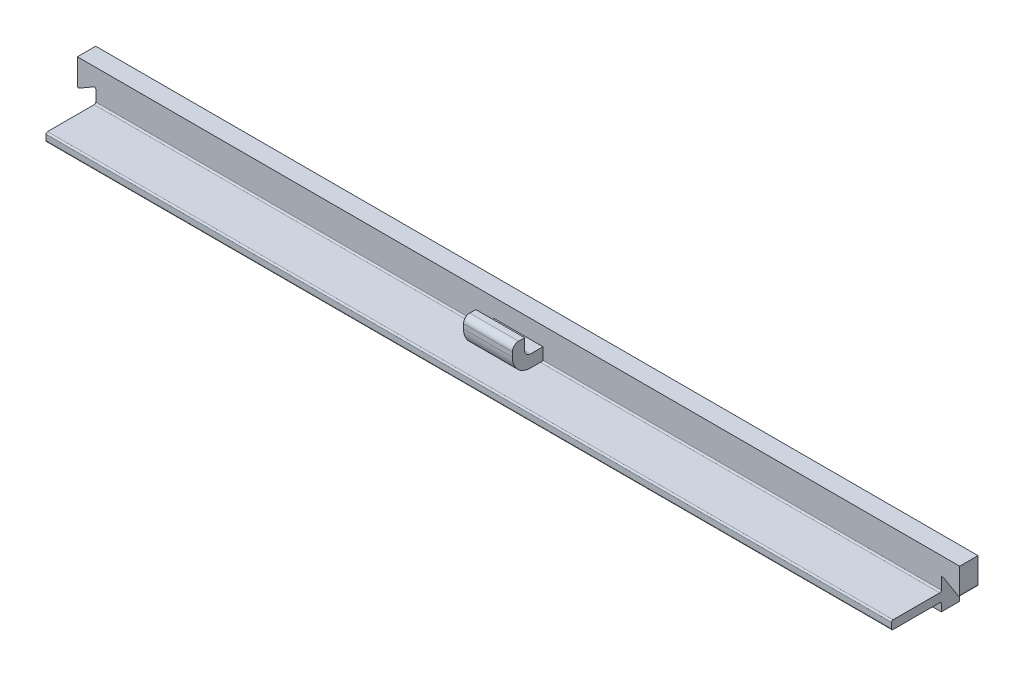
ISO-10303-21;
HEADER;
FILE_DESCRIPTION(('STEP AP214'),'2;1');
FILE_NAME('part.step','',(''),(''),'','','');
FILE_SCHEMA(('AUTOMOTIVE_DESIGN { 1 0 10303 214 1 1 1 1 }'));
ENDSEC;
DATA;
#1=APPLICATION_CONTEXT('core data for automotive mechanical design processes');
#2=APPLICATION_PROTOCOL_DEFINITION('international standard','automotive_design',2000,#1);
#3=PRODUCT_CONTEXT('',#1,'mechanical');
#4=PRODUCT('Part','Part','',(#3));
#5=PRODUCT_RELATED_PRODUCT_CATEGORY('part','',(#4));
#6=PRODUCT_DEFINITION_FORMATION('','',#4);
#7=PRODUCT_DEFINITION_CONTEXT('part definition',#1,'design');
#8=PRODUCT_DEFINITION('design','',#6,#7);
#9=PRODUCT_DEFINITION_SHAPE('','',#8);
#10=(LENGTH_UNIT() NAMED_UNIT(*) SI_UNIT(.MILLI.,.METRE.));
#11=(NAMED_UNIT(*) PLANE_ANGLE_UNIT() SI_UNIT($,.RADIAN.));
#12=(NAMED_UNIT(*) SI_UNIT($,.STERADIAN.) SOLID_ANGLE_UNIT());
#13=UNCERTAINTY_MEASURE_WITH_UNIT(LENGTH_MEASURE(1.E-05),#10,'distance_accuracy_value','');
#14=(GEOMETRIC_REPRESENTATION_CONTEXT(3) GLOBAL_UNCERTAINTY_ASSIGNED_CONTEXT((#13)) GLOBAL_UNIT_ASSIGNED_CONTEXT((#10,
#11,#12)) REPRESENTATION_CONTEXT('',''));
#15=CARTESIAN_POINT('',(0.,0.,0.));
#16=DIRECTION('',(0.,0.,1.));
#17=DIRECTION('',(1.,0.,0.));
#18=AXIS2_PLACEMENT_3D('',#15,#16,#17);
#19=CARTESIAN_POINT('',(-624.215466366464,978.535813606062,11.16));
#20=DIRECTION('',(-1.,0.,0.));
#21=DIRECTION('',(0.,-1.,0.));
#22=AXIS2_PLACEMENT_3D('',#19,#20,#21);
#23=PLANE('',#22);
#24=DIRECTION('',(0.,-1.,0.));
#25=VECTOR('',#24,1.);
#26=CARTESIAN_POINT('',(-624.215466366526,3.91828512811578E-11,3.));
#27=LINE('',#26,#25);
#28=CARTESIAN_POINT('',(-624.215466366464,977.362417099374,3.));
#29=VERTEX_POINT('',#28);
#30=CARTESIAN_POINT('',(-624.215466366465,973.229042070825,3.));
#31=VERTEX_POINT('',#30);
#32=EDGE_CURVE('E378',#29,#31,#27,.T.);
#33=ORIENTED_EDGE('',*,*,#32,.T.);
#34=DIRECTION('',(0.,0.,-1.));
#35=VECTOR('',#34,1.);
#36=CARTESIAN_POINT('',(-624.215466366464,973.229042070825,11.16));
#37=LINE('',#36,#35);
#38=CARTESIAN_POINT('',(-624.215466366465,973.229042070825,0.));
#39=VERTEX_POINT('',#38);
#40=EDGE_CURVE('E346',#31,#39,#37,.T.);
#41=ORIENTED_EDGE('',*,*,#40,.T.);
#42=DIRECTION('',(0.,-1.,0.));
#43=VECTOR('',#42,1.);
#44=CARTESIAN_POINT('',(-624.215466366526,3.91828512811578E-11,0.));
#45=LINE('',#44,#43);
#46=CARTESIAN_POINT('',(-624.215466366464,977.362417099374,0.));
#47=VERTEX_POINT('',#46);
#48=EDGE_CURVE('E317',#47,#39,#45,.T.);
#49=ORIENTED_EDGE('',*,*,#48,.F.);
#50=DIRECTION('',(0.,0.,-1.));
#51=VECTOR('',#50,1.);
#52=CARTESIAN_POINT('',(-624.215466366464,977.362417099374,3.));
#53=LINE('',#52,#51);
#54=EDGE_CURVE('E306',#29,#47,#53,.T.);
#55=ORIENTED_EDGE('',*,*,#54,.F.);
#56=EDGE_LOOP('',(#33,#41,#49,#55));
#57=FACE_BOUND('',#56,.T.);
#58=ADVANCED_FACE('F39',(#57),#23,.F.);
#59=CARTESIAN_POINT('',(-624.415466366467,973.229042070825,11.16));
#60=DIRECTION('',(0.,0.,-1.));
#61=DIRECTION('',(-1.,0.,0.));
#62=AXIS2_PLACEMENT_3D('',#59,#60,#61);
#63=CYLINDRICAL_SURFACE('',#62,0.200000000002849);
#64=CARTESIAN_POINT('',(-624.415466366467,973.229042070825,3.));
#65=DIRECTION('',(0.,0.,1.));
#66=DIRECTION('',(1.,0.,0.));
#67=AXIS2_PLACEMENT_3D('',#64,#65,#66);
#68=CIRCLE('',#67,0.200000000002849);
#69=CARTESIAN_POINT('',(-624.515466366468,973.055836990065,3.));
#70=VERTEX_POINT('',#69);
#71=EDGE_CURVE('E376',#31,#70,#68,.F.);
#72=ORIENTED_EDGE('',*,*,#71,.T.);
#73=DIRECTION('',(0.,0.,-1.));
#74=VECTOR('',#73,1.);
#75=CARTESIAN_POINT('',(-624.515466366468,973.055836990065,11.16));
#76=LINE('',#75,#74);
#77=CARTESIAN_POINT('',(-624.515466366468,973.055836990065,0.));
#78=VERTEX_POINT('',#77);
#79=EDGE_CURVE('E388',#70,#78,#76,.T.);
#80=ORIENTED_EDGE('',*,*,#79,.T.);
#81=CARTESIAN_POINT('',(-624.415466366467,973.229042070825,0.));
#82=DIRECTION('',(0.,0.,1.));
#83=DIRECTION('',(1.,0.,0.));
#84=AXIS2_PLACEMENT_3D('',#81,#82,#83);
#85=CIRCLE('',#84,0.200000000002849);
#86=EDGE_CURVE('E361',#39,#78,#85,.F.);
#87=ORIENTED_EDGE('',*,*,#86,.F.);
#88=ORIENTED_EDGE('',*,*,#40,.F.);
#89=EDGE_LOOP('',(#72,#80,#87,#88));
#90=FACE_BOUND('',#89,.T.);
#91=ADVANCED_FACE('F518',(#90),#63,.T.);
#92=CARTESIAN_POINT('',(-624.515466366468,973.055836990065,11.16));
#93=DIRECTION('',(0.499999999999698,0.866025403784613,0.));
#94=DIRECTION('',(-0.866025403784613,0.499999999999698,0.));
#95=AXIS2_PLACEMENT_3D('',#92,#93,#94);
#96=PLANE('',#95);
#97=DIRECTION('',(-0.866025403784613,0.499999999999698,0.));
#98=VECTOR('',#97,1.);
#99=CARTESIAN_POINT('',(265.216670475465,459.368748278129,3.));
#100=LINE('',#99,#98);
#101=CARTESIAN_POINT('',(-626.926154390442,974.447648369638,3.));
#102=VERTEX_POINT('',#101);
#103=EDGE_CURVE('E374',#70,#102,#100,.T.);
#104=ORIENTED_EDGE('',*,*,#103,.T.);
#105=DIRECTION('',(0.,0.,-1.));
#106=VECTOR('',#105,1.);
#107=CARTESIAN_POINT('',(-626.926154390442,974.447648369638,11.16));
#108=LINE('',#107,#106);
#109=CARTESIAN_POINT('',(-626.926154390442,974.447648369638,0.));
#110=VERTEX_POINT('',#109);
#111=EDGE_CURVE('E385',#102,#110,#108,.T.);
#112=ORIENTED_EDGE('',*,*,#111,.T.);
#113=DIRECTION('',(-0.866025403784613,0.499999999999698,0.));
#114=VECTOR('',#113,1.);
#115=CARTESIAN_POINT('',(265.216670475465,459.368748278129,0.));
#116=LINE('',#115,#114);
#117=EDGE_CURVE('E363',#78,#110,#116,.T.);
#118=ORIENTED_EDGE('',*,*,#117,.F.);
#119=ORIENTED_EDGE('',*,*,#79,.F.);
#120=EDGE_LOOP('',(#104,#112,#118,#119));
#121=FACE_BOUND('',#120,.T.);
#122=ADVANCED_FACE('F524',(#121),#96,.F.);
#123=CARTESIAN_POINT('',(-627.026154390443,974.274443288878,11.16));
#124=DIRECTION('',(0.,0.,-1.));
#125=DIRECTION('',(-1.,0.,0.));
#126=AXIS2_PLACEMENT_3D('',#123,#124,#125);
#127=CYLINDRICAL_SURFACE('',#126,0.200000000002934);
#128=CARTESIAN_POINT('',(-627.026154390443,974.274443288878,3.));
#129=DIRECTION('',(0.,0.,1.));
#130=DIRECTION('',(1.,0.,0.));
#131=AXIS2_PLACEMENT_3D('',#128,#129,#130);
#132=CIRCLE('',#131,0.200000000002934);
#133=CARTESIAN_POINT('',(-627.226154390446,974.274443288878,3.));
#134=VERTEX_POINT('',#133);
#135=EDGE_CURVE('E372',#102,#134,#132,.T.);
#136=ORIENTED_EDGE('',*,*,#135,.T.);
#137=DIRECTION('',(0.,0.,-1.));
#138=VECTOR('',#137,1.);
#139=CARTESIAN_POINT('',(-627.226154390446,974.274443288878,11.16));
#140=LINE('',#139,#138);
#141=CARTESIAN_POINT('',(-627.226154390446,974.274443288878,0.));
#142=VERTEX_POINT('',#141);
#143=EDGE_CURVE('E342',#134,#142,#140,.T.);
#144=ORIENTED_EDGE('',*,*,#143,.T.);
#145=CARTESIAN_POINT('',(-627.026154390443,974.274443288878,0.));
#146=DIRECTION('',(0.,0.,1.));
#147=DIRECTION('',(1.,0.,0.));
#148=AXIS2_PLACEMENT_3D('',#145,#146,#147);
#149=CIRCLE('',#148,0.200000000002934);
#150=EDGE_CURVE('E365',#110,#142,#149,.T.);
#151=ORIENTED_EDGE('',*,*,#150,.F.);
#152=ORIENTED_EDGE('',*,*,#111,.F.);
#153=EDGE_LOOP('',(#136,#144,#151,#152));
#154=FACE_BOUND('',#153,.T.);
#155=ADVANCED_FACE('F532',(#154),#127,.F.);
#156=CARTESIAN_POINT('',(-627.226154390446,974.274443288878,11.16));
#157=DIRECTION('',(-1.,0.,0.));
#158=DIRECTION('',(0.,-1.,0.));
#159=AXIS2_PLACEMENT_3D('',#156,#157,#158);
#160=PLANE('',#159);
#161=DIRECTION('',(0.,-1.,0.));
#162=VECTOR('',#161,1.);
#163=CARTESIAN_POINT('',(-627.226154390428,-1.15917266046248E-11,3.));
#164=LINE('',#163,#162);
#165=CARTESIAN_POINT('',(-627.226154390446,972.454875355935,3.));
#166=VERTEX_POINT('',#165);
#167=EDGE_CURVE('E370',#134,#166,#164,.T.);
#168=ORIENTED_EDGE('',*,*,#167,.T.);
#169=CARTESIAN_POINT('',(-627.226154390446,972.454875355935,3.24999999999998));
#170=DIRECTION('',(-1.,0.,0.));
#171=DIRECTION('',(0.,-1.,0.));
#172=AXIS2_PLACEMENT_3D('',#169,#170,#171);
#173=CIRCLE('',#172,0.25);
#174=CARTESIAN_POINT('',(-627.226154390446,972.204875355935,3.24999999999998));
#175=VERTEX_POINT('',#174);
#176=EDGE_CURVE('E321',#175,#166,#173,.F.);
#177=ORIENTED_EDGE('',*,*,#176,.F.);
#178=DIRECTION('',(0.,0.,-1.));
#179=VECTOR('',#178,1.);
#180=CARTESIAN_POINT('',(-627.226154390446,972.204875355935,280.647202082641));
#181=LINE('',#180,#179);
#182=CARTESIAN_POINT('',(-627.226154390446,972.204875355935,10.9));
#183=VERTEX_POINT('',#182);
#184=EDGE_CURVE('E253',#183,#175,#181,.T.);
#185=ORIENTED_EDGE('',*,*,#184,.F.);
#186=CARTESIAN_POINT('',(-627.226154390446,971.954875355935,10.9));
#187=DIRECTION('',(-1.,0.,0.));
#188=DIRECTION('',(0.,-1.,0.));
#189=AXIS2_PLACEMENT_3D('',#186,#187,#188);
#190=CIRCLE('',#189,0.25);
#191=CARTESIAN_POINT('',(-627.226154390446,971.954875355935,11.15));
#192=VERTEX_POINT('',#191);
#193=EDGE_CURVE('E249',#183,#192,#190,.F.);
#194=ORIENTED_EDGE('',*,*,#193,.T.);
#195=DIRECTION('',(0.,1.,0.));
#196=VECTOR('',#195,1.);
#197=CARTESIAN_POINT('',(-627.226154390446,998.492317099372,11.15));
#198=LINE('',#197,#196);
#199=CARTESIAN_POINT('',(-627.226154390446,971.057317099374,11.15));
#200=VERTEX_POINT('',#199);
#201=EDGE_CURVE('E237',#200,#192,#198,.T.);
#202=ORIENTED_EDGE('',*,*,#201,.F.);
#203=CARTESIAN_POINT('',(-627.226154390446,971.057317099374,10.9));
#204=DIRECTION('',(-1.,0.,0.));
#205=DIRECTION('',(0.,-1.,0.));
#206=AXIS2_PLACEMENT_3D('',#203,#204,#205);
#207=CIRCLE('',#206,0.25);
#208=CARTESIAN_POINT('',(-627.226154390446,970.807317099374,10.9));
#209=VERTEX_POINT('',#208);
#210=EDGE_CURVE('E338',#200,#209,#207,.F.);
#211=ORIENTED_EDGE('',*,*,#210,.T.);
#212=DIRECTION('',(0.,0.,1.));
#213=VECTOR('',#212,1.);
#214=CARTESIAN_POINT('',(-627.226154390446,970.807317099374,280.647202082641));
#215=LINE('',#214,#213);
#216=CARTESIAN_POINT('',(-627.226154390446,970.807317099374,3.24999999999998));
#217=VERTEX_POINT('',#216);
#218=EDGE_CURVE('E303',#217,#209,#215,.T.);
#219=ORIENTED_EDGE('',*,*,#218,.F.);
#220=CARTESIAN_POINT('',(-627.226154390446,970.557317099374,3.24999999999998));
#221=DIRECTION('',(-1.,0.,0.));
#222=DIRECTION('',(0.,-1.,0.));
#223=AXIS2_PLACEMENT_3D('',#220,#221,#222);
#224=CIRCLE('',#223,0.25);
#225=CARTESIAN_POINT('',(-627.226154390446,970.557317099374,3.));
#226=VERTEX_POINT('',#225);
#227=EDGE_CURVE('E298',#226,#217,#224,.F.);
#228=ORIENTED_EDGE('',*,*,#227,.F.);
#229=CARTESIAN_POINT('',(-627.226154390446,969.362417099374,3.));
#230=VERTEX_POINT('',#229);
#231=EDGE_CURVE('E369',#226,#230,#164,.T.);
#232=ORIENTED_EDGE('',*,*,#231,.T.);
#233=DIRECTION('',(0.,0.,-1.));
#234=VECTOR('',#233,1.);
#235=CARTESIAN_POINT('',(-627.226154390446,969.362417099374,3.));
#236=LINE('',#235,#234);
#237=CARTESIAN_POINT('',(-627.226154390446,969.362417099374,0.));
#238=VERTEX_POINT('',#237);
#239=EDGE_CURVE('E334',#230,#238,#236,.T.);
#240=ORIENTED_EDGE('',*,*,#239,.T.);
#241=DIRECTION('',(0.,-1.,0.));
#242=VECTOR('',#241,1.);
#243=CARTESIAN_POINT('',(-627.226154390428,-1.15917266046248E-11,0.));
#244=LINE('',#243,#242);
#245=EDGE_CURVE('E320',#142,#238,#244,.T.);
#246=ORIENTED_EDGE('',*,*,#245,.F.);
#247=ORIENTED_EDGE('',*,*,#143,.F.);
#248=EDGE_LOOP('',(#168,#177,#185,#194,#202,#211,#219,#228,#232,#240,#246,#247));
#249=FACE_BOUND('',#248,.T.);
#250=ADVANCED_FACE('F251',(#249),#160,.F.);
#251=CARTESIAN_POINT('',(-765.729795732973,974.274443288878,11.16));
#252=DIRECTION('',(1.,0.,0.));
#253=DIRECTION('',(0.,1.,0.));
#254=AXIS2_PLACEMENT_3D('',#251,#252,#253);
#255=PLANE('',#254);
#256=DIRECTION('',(0.,1.,0.));
#257=VECTOR('',#256,1.);
#258=CARTESIAN_POINT('',(-765.729795732991,1.41514035775155E-11,3.));
#259=LINE('',#258,#257);
#260=CARTESIAN_POINT('',(-765.729795732973,972.454875355935,3.));
#261=VERTEX_POINT('',#260);
#262=CARTESIAN_POINT('',(-765.729795732973,974.274443288878,3.));
#263=VERTEX_POINT('',#262);
#264=EDGE_CURVE('E332',#261,#263,#259,.T.);
#265=ORIENTED_EDGE('',*,*,#264,.T.);
#266=DIRECTION('',(0.,0.,-1.));
#267=VECTOR('',#266,1.);
#268=CARTESIAN_POINT('',(-765.729795732973,974.274443288878,11.16));
#269=LINE('',#268,#267);
#270=CARTESIAN_POINT('',(-765.729795732973,974.274443288878,0.));
#271=VERTEX_POINT('',#270);
#272=EDGE_CURVE('E353',#263,#271,#269,.T.);
#273=ORIENTED_EDGE('',*,*,#272,.T.);
#274=DIRECTION('',(0.,1.,0.));
#275=VECTOR('',#274,1.);
#276=CARTESIAN_POINT('',(-765.729795732991,1.41514035775155E-11,0.));
#277=LINE('',#276,#275);
#278=CARTESIAN_POINT('',(-765.729795732973,969.362417099374,0.));
#279=VERTEX_POINT('',#278);
#280=EDGE_CURVE('E307',#279,#271,#277,.T.);
#281=ORIENTED_EDGE('',*,*,#280,.F.);
#282=DIRECTION('',(0.,0.,1.));
#283=VECTOR('',#282,1.);
#284=CARTESIAN_POINT('',(-765.729795732973,969.362417099374,3.));
#285=LINE('',#284,#283);
#286=CARTESIAN_POINT('',(-765.729795732973,969.362417099374,3.));
#287=VERTEX_POINT('',#286);
#288=EDGE_CURVE('E335',#279,#287,#285,.T.);
#289=ORIENTED_EDGE('',*,*,#288,.T.);
#290=CARTESIAN_POINT('',(-765.729795732973,970.557317099374,3.));
#291=VERTEX_POINT('',#290);
#292=EDGE_CURVE('E325',#287,#291,#259,.T.);
#293=ORIENTED_EDGE('',*,*,#292,.T.);
#294=CARTESIAN_POINT('',(-765.729795732973,970.557317099374,3.24999999999998));
#295=DIRECTION('',(1.,0.,0.));
#296=DIRECTION('',(0.,1.,0.));
#297=AXIS2_PLACEMENT_3D('',#294,#295,#296);
#298=CIRCLE('',#297,0.25);
#299=CARTESIAN_POINT('',(-765.729795732973,970.807317099374,3.24999999999998));
#300=VERTEX_POINT('',#299);
#301=EDGE_CURVE('E295',#300,#291,#298,.F.);
#302=ORIENTED_EDGE('',*,*,#301,.F.);
#303=DIRECTION('',(0.,0.,-1.));
#304=VECTOR('',#303,1.);
#305=CARTESIAN_POINT('',(-765.729795732973,970.807317099374,280.647202082641));
#306=LINE('',#305,#304);
#307=CARTESIAN_POINT('',(-765.729795732973,970.807317099374,10.9));
#308=VERTEX_POINT('',#307);
#309=EDGE_CURVE('E301',#308,#300,#306,.T.);
#310=ORIENTED_EDGE('',*,*,#309,.F.);
#311=CARTESIAN_POINT('',(-765.729795732973,971.057317099374,10.9));
#312=DIRECTION('',(1.,0.,0.));
#313=DIRECTION('',(0.,1.,0.));
#314=AXIS2_PLACEMENT_3D('',#311,#312,#313);
#315=CIRCLE('',#314,0.25);
#316=CARTESIAN_POINT('',(-765.729795732973,971.057317099374,11.15));
#317=VERTEX_POINT('',#316);
#318=EDGE_CURVE('E257',#308,#317,#315,.F.);
#319=ORIENTED_EDGE('',*,*,#318,.T.);
#320=DIRECTION('',(0.,-1.,0.));
#321=VECTOR('',#320,1.);
#322=CARTESIAN_POINT('',(-765.729795732972,998.492317099379,11.15));
#323=LINE('',#322,#321);
#324=CARTESIAN_POINT('',(-765.729795732973,971.954875355935,11.15));
#325=VERTEX_POINT('',#324);
#326=EDGE_CURVE('E245',#325,#317,#323,.T.);
#327=ORIENTED_EDGE('',*,*,#326,.F.);
#328=CARTESIAN_POINT('',(-765.729795732973,971.954875355935,10.9));
#329=DIRECTION('',(1.,0.,0.));
#330=DIRECTION('',(0.,1.,0.));
#331=AXIS2_PLACEMENT_3D('',#328,#329,#330);
#332=CIRCLE('',#331,0.25);
#333=CARTESIAN_POINT('',(-765.729795732973,972.204875355935,10.9));
#334=VERTEX_POINT('',#333);
#335=EDGE_CURVE('E258',#325,#334,#332,.F.);
#336=ORIENTED_EDGE('',*,*,#335,.T.);
#337=DIRECTION('',(0.,0.,1.));
#338=VECTOR('',#337,1.);
#339=CARTESIAN_POINT('',(-765.729795732973,972.204875355935,280.647202082641));
#340=LINE('',#339,#338);
#341=CARTESIAN_POINT('',(-765.729795732973,972.204875355935,3.24999999999998));
#342=VERTEX_POINT('',#341);
#343=EDGE_CURVE('E246',#342,#334,#340,.T.);
#344=ORIENTED_EDGE('',*,*,#343,.F.);
#345=CARTESIAN_POINT('',(-765.729795732973,972.454875355935,3.24999999999998));
#346=DIRECTION('',(1.,0.,0.));
#347=DIRECTION('',(0.,1.,0.));
#348=AXIS2_PLACEMENT_3D('',#345,#346,#347);
#349=CIRCLE('',#348,0.25);
#350=EDGE_CURVE('E318',#261,#342,#349,.F.);
#351=ORIENTED_EDGE('',*,*,#350,.F.);
#352=EDGE_LOOP('',(#265,#273,#281,#289,#293,#302,#310,#319,#327,#336,#344,#351));
#353=FACE_BOUND('',#352,.T.);
#354=ADVANCED_FACE('F536',(#353),#255,.F.);
#355=CARTESIAN_POINT('',(-765.929795732976,974.274443288878,11.16));
#356=DIRECTION('',(0.,0.,-1.));
#357=DIRECTION('',(-1.,0.,0.));
#358=AXIS2_PLACEMENT_3D('',#355,#356,#357);
#359=CYLINDRICAL_SURFACE('',#358,0.200000000002934);
#360=CARTESIAN_POINT('',(-765.929795732976,974.274443288878,3.));
#361=DIRECTION('',(0.,0.,1.));
#362=DIRECTION('',(1.,0.,0.));
#363=AXIS2_PLACEMENT_3D('',#360,#361,#362);
#364=CIRCLE('',#363,0.200000000002934);
#365=CARTESIAN_POINT('',(-766.029795732977,974.447648369637,3.));
#366=VERTEX_POINT('',#365);
#367=EDGE_CURVE('E330',#263,#366,#364,.T.);
#368=ORIENTED_EDGE('',*,*,#367,.T.);
#369=DIRECTION('',(0.,0.,-1.));
#370=VECTOR('',#369,1.);
#371=CARTESIAN_POINT('',(-766.029795732977,974.447648369638,11.16));
#372=LINE('',#371,#370);
#373=CARTESIAN_POINT('',(-766.029795732977,974.447648369637,0.));
#374=VERTEX_POINT('',#373);
#375=EDGE_CURVE('E350',#366,#374,#372,.T.);
#376=ORIENTED_EDGE('',*,*,#375,.T.);
#377=CARTESIAN_POINT('',(-765.929795732976,974.274443288878,0.));
#378=DIRECTION('',(0.,0.,1.));
#379=DIRECTION('',(1.,0.,0.));
#380=AXIS2_PLACEMENT_3D('',#377,#378,#379);
#381=CIRCLE('',#380,0.200000000002934);
#382=EDGE_CURVE('E309',#271,#374,#381,.T.);
#383=ORIENTED_EDGE('',*,*,#382,.F.);
#384=ORIENTED_EDGE('',*,*,#272,.F.);
#385=EDGE_LOOP('',(#368,#376,#383,#384));
#386=FACE_BOUND('',#385,.T.);
#387=ADVANCED_FACE('F542',(#386),#359,.F.);
#388=CARTESIAN_POINT('',(-768.440483756951,973.055836990065,11.16));
#389=DIRECTION('',(-0.499999999999698,0.866025403784613,0.));
#390=DIRECTION('',(-0.866025403784613,-0.499999999999698,0.));
#391=AXIS2_PLACEMENT_3D('',#388,#389,#390);
#392=PLANE('',#391);
#393=DIRECTION('',(-0.866025403784613,-0.499999999999698,0.));
#394=VECTOR('',#393,1.);
#395=CARTESIAN_POINT('',(-613.455658005899,1062.53636785767,3.));
#396=LINE('',#395,#394);
#397=CARTESIAN_POINT('',(-768.440483756951,973.055836990065,3.));
#398=VERTEX_POINT('',#397);
#399=EDGE_CURVE('E328',#366,#398,#396,.T.);
#400=ORIENTED_EDGE('',*,*,#399,.T.);
#401=DIRECTION('',(0.,0.,-1.));
#402=VECTOR('',#401,1.);
#403=CARTESIAN_POINT('',(-768.440483756951,973.055836990065,11.16));
#404=LINE('',#403,#402);
#405=CARTESIAN_POINT('',(-768.440483756951,973.055836990065,0.));
#406=VERTEX_POINT('',#405);
#407=EDGE_CURVE('E347',#398,#406,#404,.T.);
#408=ORIENTED_EDGE('',*,*,#407,.T.);
#409=DIRECTION('',(-0.866025403784613,-0.499999999999698,0.));
#410=VECTOR('',#409,1.);
#411=CARTESIAN_POINT('',(-613.455658005899,1062.53636785767,0.));
#412=LINE('',#411,#410);
#413=EDGE_CURVE('E311',#374,#406,#412,.T.);
#414=ORIENTED_EDGE('',*,*,#413,.F.);
#415=ORIENTED_EDGE('',*,*,#375,.F.);
#416=EDGE_LOOP('',(#400,#408,#414,#415));
#417=FACE_BOUND('',#416,.T.);
#418=ADVANCED_FACE('F546',(#417),#392,.F.);
#419=CARTESIAN_POINT('',(-768.540483756952,973.229042070825,11.16));
#420=DIRECTION('',(0.,0.,-1.));
#421=DIRECTION('',(-1.,0.,0.));
#422=AXIS2_PLACEMENT_3D('',#419,#420,#421);
#423=CYLINDRICAL_SURFACE('',#422,0.200000000002849);
#424=CARTESIAN_POINT('',(-768.540483756952,973.229042070825,3.));
#425=DIRECTION('',(0.,0.,1.));
#426=DIRECTION('',(1.,0.,0.));
#427=AXIS2_PLACEMENT_3D('',#424,#425,#426);
#428=CIRCLE('',#427,0.200000000002849);
#429=CARTESIAN_POINT('',(-768.740483756955,973.229042070825,3.));
#430=VERTEX_POINT('',#429);
#431=EDGE_CURVE('E326',#398,#430,#428,.F.);
#432=ORIENTED_EDGE('',*,*,#431,.T.);
#433=DIRECTION('',(0.,0.,-1.));
#434=VECTOR('',#433,1.);
#435=CARTESIAN_POINT('',(-768.740483756955,973.229042070825,11.16));
#436=LINE('',#435,#434);
#437=CARTESIAN_POINT('',(-768.740483756955,973.229042070825,0.));
#438=VERTEX_POINT('',#437);
#439=EDGE_CURVE('E343',#430,#438,#436,.T.);
#440=ORIENTED_EDGE('',*,*,#439,.T.);
#441=CARTESIAN_POINT('',(-768.540483756952,973.229042070825,0.));
#442=DIRECTION('',(0.,0.,1.));
#443=DIRECTION('',(1.,0.,0.));
#444=AXIS2_PLACEMENT_3D('',#441,#442,#443);
#445=CIRCLE('',#444,0.200000000002849);
#446=EDGE_CURVE('E313',#406,#438,#445,.F.);
#447=ORIENTED_EDGE('',*,*,#446,.F.);
#448=ORIENTED_EDGE('',*,*,#407,.F.);
#449=EDGE_LOOP('',(#432,#440,#447,#448));
#450=FACE_BOUND('',#449,.T.);
#451=ADVANCED_FACE('F513',(#450),#423,.T.);
#452=CARTESIAN_POINT('',(-768.740483756955,978.535813606062,11.16));
#453=DIRECTION('',(1.,0.,0.));
#454=DIRECTION('',(0.,0.,-1.));
#455=AXIS2_PLACEMENT_3D('',#452,#453,#454);
#456=PLANE('',#455);
#457=DIRECTION('',(0.,1.,0.));
#458=VECTOR('',#457,1.);
#459=CARTESIAN_POINT('',(-768.740483756955,0.,3.));
#460=LINE('',#459,#458);
#461=CARTESIAN_POINT('',(-768.740483756955,977.362417099374,3.));
#462=VERTEX_POINT('',#461);
#463=EDGE_CURVE('E322',#430,#462,#460,.T.);
#464=ORIENTED_EDGE('',*,*,#463,.T.);
#465=DIRECTION('',(0.,0.,1.));
#466=VECTOR('',#465,1.);
#467=CARTESIAN_POINT('',(-768.740483756955,977.362417099374,3.));
#468=LINE('',#467,#466);
#469=CARTESIAN_POINT('',(-768.740483756955,977.362417099374,0.));
#470=VERTEX_POINT('',#469);
#471=EDGE_CURVE('E304',#470,#462,#468,.T.);
#472=ORIENTED_EDGE('',*,*,#471,.F.);
#473=DIRECTION('',(0.,1.,0.));
#474=VECTOR('',#473,1.);
#475=CARTESIAN_POINT('',(-768.740483756955,0.,0.));
#476=LINE('',#475,#474);
#477=EDGE_CURVE('E315',#438,#470,#476,.T.);
#478=ORIENTED_EDGE('',*,*,#477,.F.);
#479=ORIENTED_EDGE('',*,*,#439,.F.);
#480=EDGE_LOOP('',(#464,#472,#478,#479));
#481=FACE_BOUND('',#480,.T.);
#482=ADVANCED_FACE('F506',(#481),#456,.F.);
#483=CARTESIAN_POINT('',(-700.477975061709,975.310173342221,5.05274007190232));
#484=DIRECTION('',(1.,0.,0.));
#485=DIRECTION('',(0.,0.,-1.));
#486=AXIS2_PLACEMENT_3D('',#483,#484,#485);
#487=CYLINDRICAL_SURFACE('',#486,2.94775624284737);
#488=DIRECTION('',(1.,0.,0.));
#489=VECTOR('',#488,1.);
#490=CARTESIAN_POINT('',(-700.477975061709,972.362417099374,5.05274007190232));
#491=LINE('',#490,#489);
#492=CARTESIAN_POINT('',(-700.477975061709,972.362417099374,5.05274007190232));
#493=VERTEX_POINT('',#492);
#494=CARTESIAN_POINT('',(-692.477975061709,972.362417099374,5.05274007190232));
#495=VERTEX_POINT('',#494);
#496=EDGE_CURVE('E293',#493,#495,#491,.T.);
#497=ORIENTED_EDGE('',*,*,#496,.T.);
#498=CARTESIAN_POINT('',(-692.477975061709,975.310173342221,5.05274007190232));
#499=DIRECTION('',(1.,0.,0.));
#500=DIRECTION('',(0.,0.,1.));
#501=AXIS2_PLACEMENT_3D('',#498,#499,#500);
#502=CIRCLE('',#501,2.94775624284737);
#503=CARTESIAN_POINT('',(-692.477975061709,975.3642638541,8.));
#504=VERTEX_POINT('',#503);
#505=EDGE_CURVE('E409',#504,#495,#502,.T.);
#506=ORIENTED_EDGE('',*,*,#505,.F.);
#507=DIRECTION('',(1.,0.,0.));
#508=VECTOR('',#507,1.);
#509=CARTESIAN_POINT('',(-700.477975061709,975.3642638541,8.));
#510=LINE('',#509,#508);
#511=CARTESIAN_POINT('',(-700.477975061709,975.3642638541,8.));
#512=VERTEX_POINT('',#511);
#513=EDGE_CURVE('E442',#512,#504,#510,.T.);
#514=ORIENTED_EDGE('',*,*,#513,.F.);
#515=CARTESIAN_POINT('',(-700.477975061709,975.310173342221,5.05274007190232));
#516=DIRECTION('',(1.,0.,0.));
#517=DIRECTION('',(0.,0.,1.));
#518=AXIS2_PLACEMENT_3D('',#515,#516,#517);
#519=CIRCLE('',#518,2.94775624284737);
#520=EDGE_CURVE('E434',#512,#493,#519,.T.);
#521=ORIENTED_EDGE('',*,*,#520,.T.);
#522=EDGE_LOOP('',(#497,#506,#514,#521));
#523=FACE_BOUND('',#522,.T.);
#524=ADVANCED_FACE('F504',(#523),#487,.T.);
#525=CARTESIAN_POINT('',(-700.477975061709,976.137185247706,8.));
#526=DIRECTION('',(0.,0.,1.));
#527=DIRECTION('',(1.,0.,0.));
#528=AXIS2_PLACEMENT_3D('',#525,#526,#527);
#529=PLANE('',#528);
#530=ORIENTED_EDGE('',*,*,#513,.T.);
#531=DIRECTION('',(0.,-1.,0.));
#532=VECTOR('',#531,1.);
#533=CARTESIAN_POINT('',(-692.477975061709,976.137185247706,8.));
#534=LINE('',#533,#532);
#535=CARTESIAN_POINT('',(-692.477975061709,976.137185247706,8.));
#536=VERTEX_POINT('',#535);
#537=EDGE_CURVE('E406',#536,#504,#534,.T.);
#538=ORIENTED_EDGE('',*,*,#537,.F.);
#539=DIRECTION('',(1.,0.,0.));
#540=VECTOR('',#539,1.);
#541=CARTESIAN_POINT('',(-700.477975061709,976.137185247706,8.));
#542=LINE('',#541,#540);
#543=CARTESIAN_POINT('',(-700.477975061709,976.137185247706,8.));
#544=VERTEX_POINT('',#543);
#545=EDGE_CURVE('E444',#544,#536,#542,.T.);
#546=ORIENTED_EDGE('',*,*,#545,.F.);
#547=DIRECTION('',(0.,-1.,0.));
#548=VECTOR('',#547,1.);
#549=CARTESIAN_POINT('',(-700.477975061709,976.137185247706,8.));
#550=LINE('',#549,#548);
#551=EDGE_CURVE('E431',#544,#512,#550,.T.);
#552=ORIENTED_EDGE('',*,*,#551,.T.);
#553=EDGE_LOOP('',(#530,#538,#546,#552));
#554=FACE_BOUND('',#553,.T.);
#555=ADVANCED_FACE('F502',(#554),#529,.T.);
#556=CARTESIAN_POINT('',(-700.477975061709,976.137185247706,7.));
#557=DIRECTION('',(1.,0.,0.));
#558=DIRECTION('',(0.,0.,-1.));
#559=AXIS2_PLACEMENT_3D('',#556,#557,#558);
#560=CYLINDRICAL_SURFACE('',#559,1.);
#561=ORIENTED_EDGE('',*,*,#545,.T.);
#562=CARTESIAN_POINT('',(-692.477975061709,976.137185247706,7.));
#563=DIRECTION('',(1.,0.,0.));
#564=DIRECTION('',(0.,0.,1.));
#565=AXIS2_PLACEMENT_3D('',#562,#563,#564);
#566=CIRCLE('',#565,1.);
#567=CARTESIAN_POINT('',(-692.477975061709,977.137185247706,6.99999999999999));
#568=VERTEX_POINT('',#567);
#569=EDGE_CURVE('E403',#568,#536,#566,.T.);
#570=ORIENTED_EDGE('',*,*,#569,.F.);
#571=DIRECTION('',(1.,0.,0.));
#572=VECTOR('',#571,1.);
#573=CARTESIAN_POINT('',(-700.477975061709,977.137185247706,6.99999999999999));
#574=LINE('',#573,#572);
#575=CARTESIAN_POINT('',(-700.477975061709,977.137185247706,6.99999999999999));
#576=VERTEX_POINT('',#575);
#577=EDGE_CURVE('E446',#576,#568,#574,.T.);
#578=ORIENTED_EDGE('',*,*,#577,.F.);
#579=CARTESIAN_POINT('',(-700.477975061709,976.137185247706,7.));
#580=DIRECTION('',(1.,0.,0.));
#581=DIRECTION('',(0.,0.,1.));
#582=AXIS2_PLACEMENT_3D('',#579,#580,#581);
#583=CIRCLE('',#582,1.);
#584=EDGE_CURVE('E428',#576,#544,#583,.T.);
#585=ORIENTED_EDGE('',*,*,#584,.T.);
#586=EDGE_LOOP('',(#561,#570,#578,#585));
#587=FACE_BOUND('',#586,.T.);
#588=ADVANCED_FACE('F497',(#587),#560,.T.);
#589=CARTESIAN_POINT('',(-700.477975061709,977.137185247706,6.));
#590=DIRECTION('',(0.,1.,0.));
#591=DIRECTION('',(0.,0.,1.));
#592=AXIS2_PLACEMENT_3D('',#589,#590,#591);
#593=PLANE('',#592);
#594=ORIENTED_EDGE('',*,*,#577,.T.);
#595=DIRECTION('',(0.,0.,1.));
#596=VECTOR('',#595,1.);
#597=CARTESIAN_POINT('',(-692.477975061709,977.137185247706,6.));
#598=LINE('',#597,#596);
#599=CARTESIAN_POINT('',(-692.477975061709,977.137185247706,6.));
#600=VERTEX_POINT('',#599);
#601=EDGE_CURVE('E400',#600,#568,#598,.T.);
#602=ORIENTED_EDGE('',*,*,#601,.F.);
#603=DIRECTION('',(1.,0.,0.));
#604=VECTOR('',#603,1.);
#605=CARTESIAN_POINT('',(-700.477975061709,977.137185247706,6.));
#606=LINE('',#605,#604);
#607=CARTESIAN_POINT('',(-700.477975061709,977.137185247706,6.));
#608=VERTEX_POINT('',#607);
#609=EDGE_CURVE('E448',#608,#600,#606,.T.);
#610=ORIENTED_EDGE('',*,*,#609,.F.);
#611=DIRECTION('',(0.,0.,1.));
#612=VECTOR('',#611,1.);
#613=CARTESIAN_POINT('',(-700.477975061709,977.137185247706,6.));
#614=LINE('',#613,#612);
#615=EDGE_CURVE('E425',#608,#576,#614,.T.);
#616=ORIENTED_EDGE('',*,*,#615,.T.);
#617=EDGE_LOOP('',(#594,#602,#610,#616));
#618=FACE_BOUND('',#617,.T.);
#619=ADVANCED_FACE('F493',(#618),#593,.T.);
#620=CARTESIAN_POINT('',(-700.477975061709,975.3642638541,6.));
#621=DIRECTION('',(0.,0.,-1.));
#622=DIRECTION('',(0.,1.,0.));
#623=AXIS2_PLACEMENT_3D('',#620,#621,#622);
#624=PLANE('',#623);
#625=ORIENTED_EDGE('',*,*,#609,.T.);
#626=DIRECTION('',(0.,1.,0.));
#627=VECTOR('',#626,1.);
#628=CARTESIAN_POINT('',(-692.477975061709,975.3642638541,6.));
#629=LINE('',#628,#627);
#630=CARTESIAN_POINT('',(-692.477975061709,975.3642638541,6.));
#631=VERTEX_POINT('',#630);
#632=EDGE_CURVE('E397',#631,#600,#629,.T.);
#633=ORIENTED_EDGE('',*,*,#632,.F.);
#634=DIRECTION('',(1.,0.,0.));
#635=VECTOR('',#634,1.);
#636=CARTESIAN_POINT('',(-700.477975061709,975.3642638541,6.));
#637=LINE('',#636,#635);
#638=CARTESIAN_POINT('',(-700.477975061709,975.3642638541,6.));
#639=VERTEX_POINT('',#638);
#640=EDGE_CURVE('E450',#639,#631,#637,.T.);
#641=ORIENTED_EDGE('',*,*,#640,.F.);
#642=DIRECTION('',(0.,1.,0.));
#643=VECTOR('',#642,1.);
#644=CARTESIAN_POINT('',(-700.477975061709,975.3642638541,6.));
#645=LINE('',#644,#643);
#646=EDGE_CURVE('E422',#639,#608,#645,.T.);
#647=ORIENTED_EDGE('',*,*,#646,.T.);
#648=EDGE_LOOP('',(#625,#633,#641,#647));
#649=FACE_BOUND('',#648,.T.);
#650=ADVANCED_FACE('F491',(#649),#624,.T.);
#651=CARTESIAN_POINT('',(-700.477975061709,975.3642638541,4.99658043428849));
#652=DIRECTION('',(1.,0.,0.));
#653=DIRECTION('',(0.,0.,-1.));
#654=AXIS2_PLACEMENT_3D('',#651,#652,#653);
#655=CYLINDRICAL_SURFACE('',#654,1.00341956571151);
#656=ORIENTED_EDGE('',*,*,#640,.T.);
#657=CARTESIAN_POINT('',(-692.477975061709,975.3642638541,4.99658043428849));
#658=DIRECTION('',(-1.,0.,0.));
#659=DIRECTION('',(0.,0.,-1.));
#660=AXIS2_PLACEMENT_3D('',#657,#658,#659);
#661=CIRCLE('',#660,1.00341956571151);
#662=CARTESIAN_POINT('',(-692.477975061709,974.362417099374,5.05274007190232));
#663=VERTEX_POINT('',#662);
#664=EDGE_CURVE('E394',#663,#631,#661,.T.);
#665=ORIENTED_EDGE('',*,*,#664,.F.);
#666=DIRECTION('',(1.,0.,0.));
#667=VECTOR('',#666,1.);
#668=CARTESIAN_POINT('',(-700.477975061709,974.362417099374,5.05274007190232));
#669=LINE('',#668,#667);
#670=CARTESIAN_POINT('',(-700.477975061709,974.362417099374,5.05274007190232));
#671=VERTEX_POINT('',#670);
#672=EDGE_CURVE('E61',#671,#663,#669,.T.);
#673=ORIENTED_EDGE('',*,*,#672,.F.);
#674=CARTESIAN_POINT('',(-700.477975061709,975.3642638541,4.99658043428849));
#675=DIRECTION('',(-1.,0.,0.));
#676=DIRECTION('',(0.,0.,-1.));
#677=AXIS2_PLACEMENT_3D('',#674,#675,#676);
#678=CIRCLE('',#677,1.00341956571151);
#679=EDGE_CURVE('E419',#671,#639,#678,.T.);
#680=ORIENTED_EDGE('',*,*,#679,.T.);
#681=EDGE_LOOP('',(#656,#665,#673,#680));
#682=FACE_BOUND('',#681,.T.);
#683=ADVANCED_FACE('F486',(#682),#655,.F.);
#684=CARTESIAN_POINT('',(-700.477975061709,974.362417099374,3.));
#685=DIRECTION('',(0.,1.,0.));
#686=DIRECTION('',(0.,0.,1.));
#687=AXIS2_PLACEMENT_3D('',#684,#685,#686);
#688=PLANE('',#687);
#689=ORIENTED_EDGE('',*,*,#672,.T.);
#690=DIRECTION('',(0.,0.,1.));
#691=VECTOR('',#690,1.);
#692=CARTESIAN_POINT('',(-692.477975061709,974.362417099374,3.));
#693=LINE('',#692,#691);
#694=CARTESIAN_POINT('',(-692.477975061709,974.362417099374,3.));
#695=VERTEX_POINT('',#694);
#696=EDGE_CURVE('E48',#695,#663,#693,.T.);
#697=ORIENTED_EDGE('',*,*,#696,.F.);
#698=DIRECTION('',(1.,0.,0.));
#699=VECTOR('',#698,1.);
#700=CARTESIAN_POINT('',(-700.477975061709,974.362417099374,3.));
#701=LINE('',#700,#699);
#702=CARTESIAN_POINT('',(-700.477975061709,974.362417099374,3.));
#703=VERTEX_POINT('',#702);
#704=EDGE_CURVE('E440',#703,#695,#701,.T.);
#705=ORIENTED_EDGE('',*,*,#704,.F.);
#706=DIRECTION('',(0.,0.,1.));
#707=VECTOR('',#706,1.);
#708=CARTESIAN_POINT('',(-700.477975061709,974.362417099374,3.));
#709=LINE('',#708,#707);
#710=EDGE_CURVE('E417',#703,#671,#709,.T.);
#711=ORIENTED_EDGE('',*,*,#710,.T.);
#712=EDGE_LOOP('',(#689,#697,#705,#711));
#713=FACE_BOUND('',#712,.T.);
#714=ADVANCED_FACE('F481',(#713),#688,.T.);
#715=CARTESIAN_POINT('',(-700.477975061709,975.3642638541,4.99658043428849));
#716=DIRECTION('',(1.,0.,0.));
#717=DIRECTION('',(0.,0.,-1.));
#718=AXIS2_PLACEMENT_3D('',#715,#716,#717);
#719=PLANE('',#718);
#720=DIRECTION('',(0.,1.,0.));
#721=VECTOR('',#720,1.);
#722=CARTESIAN_POINT('',(-700.477975061709,972.362417099374,3.));
#723=LINE('',#722,#721);
#724=CARTESIAN_POINT('',(-700.477975061709,972.454875355935,3.));
#725=VERTEX_POINT('',#724);
#726=EDGE_CURVE('E414',#725,#703,#723,.T.);
#727=ORIENTED_EDGE('',*,*,#726,.F.);
#728=CARTESIAN_POINT('',(-700.477975061709,972.454875355935,3.24999999999998));
#729=DIRECTION('',(1.,0.,0.));
#730=DIRECTION('',(0.,0.,-1.));
#731=AXIS2_PLACEMENT_3D('',#728,#729,#730);
#732=CIRCLE('',#731,0.25);
#733=CARTESIAN_POINT('',(-700.477975061709,972.362417099374,3.01772544092439));
#734=VERTEX_POINT('',#733);
#735=EDGE_CURVE('E297',#725,#734,#732,.F.);
#736=ORIENTED_EDGE('',*,*,#735,.T.);
#737=DIRECTION('',(0.,0.,-1.));
#738=VECTOR('',#737,1.);
#739=CARTESIAN_POINT('',(-700.477975061709,972.362417099374,5.05274007190232));
#740=LINE('',#739,#738);
#741=EDGE_CURVE('E437',#493,#734,#740,.T.);
#742=ORIENTED_EDGE('',*,*,#741,.F.);
#743=ORIENTED_EDGE('',*,*,#520,.F.);
#744=ORIENTED_EDGE('',*,*,#551,.F.);
#745=ORIENTED_EDGE('',*,*,#584,.F.);
#746=ORIENTED_EDGE('',*,*,#615,.F.);
#747=ORIENTED_EDGE('',*,*,#646,.F.);
#748=ORIENTED_EDGE('',*,*,#679,.F.);
#749=ORIENTED_EDGE('',*,*,#710,.F.);
#750=EDGE_LOOP('',(#727,#736,#742,#743,#744,#745,#746,#747,#748,#749));
#751=FACE_BOUND('',#750,.T.);
#752=ADVANCED_FACE('F464',(#751),#719,.F.);
#753=CARTESIAN_POINT('',(-700.477975061709,972.362417099374,5.05274007190232));
#754=DIRECTION('',(0.,-1.,0.));
#755=DIRECTION('',(0.,0.,-1.));
#756=AXIS2_PLACEMENT_3D('',#753,#754,#755);
#757=PLANE('',#756);
#758=DIRECTION('',(-1.,0.,0.));
#759=VECTOR('',#758,1.);
#760=CARTESIAN_POINT('',(-826.466985683435,972.362417099374,3.01772544092439));
#761=LINE('',#760,#759);
#762=CARTESIAN_POINT('',(-692.477975061709,972.362417099374,3.01772544092439));
#763=VERTEX_POINT('',#762);
#764=EDGE_CURVE('E457',#763,#734,#761,.T.);
#765=ORIENTED_EDGE('',*,*,#764,.F.);
#766=DIRECTION('',(0.,0.,-1.));
#767=VECTOR('',#766,1.);
#768=CARTESIAN_POINT('',(-692.477975061709,972.362417099374,5.05274007190232));
#769=LINE('',#768,#767);
#770=EDGE_CURVE('E412',#495,#763,#769,.T.);
#771=ORIENTED_EDGE('',*,*,#770,.F.);
#772=ORIENTED_EDGE('',*,*,#496,.F.);
#773=ORIENTED_EDGE('',*,*,#741,.T.);
#774=EDGE_LOOP('',(#765,#771,#772,#773));
#775=FACE_BOUND('',#774,.T.);
#776=ADVANCED_FACE('F471',(#775),#757,.T.);
#777=CARTESIAN_POINT('',(-692.477975061709,975.3642638541,4.99658043428849));
#778=DIRECTION('',(1.,0.,0.));
#779=DIRECTION('',(0.,0.,-1.));
#780=AXIS2_PLACEMENT_3D('',#777,#778,#779);
#781=PLANE('',#780);
#782=CARTESIAN_POINT('',(-692.477975061709,972.454875355935,3.24999999999998));
#783=DIRECTION('',(1.,0.,0.));
#784=DIRECTION('',(0.,0.,-1.));
#785=AXIS2_PLACEMENT_3D('',#782,#783,#784);
#786=CIRCLE('',#785,0.25);
#787=CARTESIAN_POINT('',(-692.477975061709,972.454875355935,3.));
#788=VERTEX_POINT('',#787);
#789=EDGE_CURVE('E267',#788,#763,#786,.F.);
#790=ORIENTED_EDGE('',*,*,#789,.F.);
#791=DIRECTION('',(0.,1.,0.));
#792=VECTOR('',#791,1.);
#793=CARTESIAN_POINT('',(-692.477975061709,972.362417099374,3.));
#794=LINE('',#793,#792);
#795=EDGE_CURVE('E11',#788,#695,#794,.T.);
#796=ORIENTED_EDGE('',*,*,#795,.T.);
#797=ORIENTED_EDGE('',*,*,#696,.T.);
#798=ORIENTED_EDGE('',*,*,#664,.T.);
#799=ORIENTED_EDGE('',*,*,#632,.T.);
#800=ORIENTED_EDGE('',*,*,#601,.T.);
#801=ORIENTED_EDGE('',*,*,#569,.T.);
#802=ORIENTED_EDGE('',*,*,#537,.T.);
#803=ORIENTED_EDGE('',*,*,#505,.T.);
#804=ORIENTED_EDGE('',*,*,#770,.T.);
#805=EDGE_LOOP('',(#790,#796,#797,#798,#799,#800,#801,#802,#803,#804));
#806=FACE_BOUND('',#805,.T.);
#807=ADVANCED_FACE('F477',(#806),#781,.T.);
#808=CARTESIAN_POINT('',(0.,0.,0.));
#809=DIRECTION('',(0.,0.,1.));
#810=DIRECTION('',(1.,0.,0.));
#811=AXIS2_PLACEMENT_3D('',#808,#809,#810);
#812=PLANE('',#811);
#813=ORIENTED_EDGE('',*,*,#150,.T.);
#814=ORIENTED_EDGE('',*,*,#245,.T.);
#815=DIRECTION('',(-1.,0.,0.));
#816=VECTOR('',#815,1.);
#817=CARTESIAN_POINT('',(-542.83545763174,969.362417099374,0.));
#818=LINE('',#817,#816);
#819=EDGE_CURVE('E290',#238,#279,#818,.T.);
#820=ORIENTED_EDGE('',*,*,#819,.T.);
#821=ORIENTED_EDGE('',*,*,#280,.T.);
#822=ORIENTED_EDGE('',*,*,#382,.T.);
#823=ORIENTED_EDGE('',*,*,#413,.T.);
#824=ORIENTED_EDGE('',*,*,#446,.T.);
#825=ORIENTED_EDGE('',*,*,#477,.T.);
#826=DIRECTION('',(-1.,0.,0.));
#827=VECTOR('',#826,1.);
#828=CARTESIAN_POINT('',(-529.797975061709,977.362417099374,0.));
#829=LINE('',#828,#827);
#830=EDGE_CURVE('E283',#47,#470,#829,.T.);
#831=ORIENTED_EDGE('',*,*,#830,.F.);
#832=ORIENTED_EDGE('',*,*,#48,.T.);
#833=ORIENTED_EDGE('',*,*,#86,.T.);
#834=ORIENTED_EDGE('',*,*,#117,.T.);
#835=EDGE_LOOP('',(#813,#814,#820,#821,#822,#823,#824,#825,#831,#832,#833,#834));
#836=FACE_BOUND('',#835,.T.);
#837=ADVANCED_FACE('F558',(#836),#812,.F.);
#838=CARTESIAN_POINT('',(-826.466985683435,972.454875355935,3.24999999999998));
#839=DIRECTION('',(-1.,0.,0.));
#840=DIRECTION('',(0.,0.,1.));
#841=AXIS2_PLACEMENT_3D('',#838,#839,#840);
#842=CYLINDRICAL_SURFACE('',#841,0.25);
#843=DIRECTION('',(-1.,0.,0.));
#844=VECTOR('',#843,1.);
#845=CARTESIAN_POINT('',(-826.466985683435,972.204875355935,3.24999999999998));
#846=LINE('',#845,#844);
#847=EDGE_CURVE('E263',#175,#342,#846,.T.);
#848=ORIENTED_EDGE('',*,*,#847,.F.);
#849=ORIENTED_EDGE('',*,*,#176,.T.);
#850=DIRECTION('',(-1.,0.,0.));
#851=VECTOR('',#850,1.);
#852=CARTESIAN_POINT('',(0.,972.454875355935,3.));
#853=LINE('',#852,#851);
#854=EDGE_CURVE('E284',#788,#166,#853,.F.);
#855=ORIENTED_EDGE('',*,*,#854,.F.);
#856=ORIENTED_EDGE('',*,*,#789,.T.);
#857=ORIENTED_EDGE('',*,*,#764,.T.);
#858=ORIENTED_EDGE('',*,*,#735,.F.);
#859=EDGE_CURVE('E279',#261,#725,#853,.F.);
#860=ORIENTED_EDGE('',*,*,#859,.F.);
#861=ORIENTED_EDGE('',*,*,#350,.T.);
#862=EDGE_LOOP('',(#848,#849,#855,#856,#857,#858,#860,#861));
#863=FACE_BOUND('',#862,.T.);
#864=ADVANCED_FACE('F474',(#863),#842,.F.);
#865=CARTESIAN_POINT('',(-558.397968967211,970.807317099374,280.647202082641));
#866=DIRECTION('',(0.,1.,0.));
#867=DIRECTION('',(0.,0.,1.));
#868=AXIS2_PLACEMENT_3D('',#865,#866,#867);
#869=PLANE('',#868);
#870=DIRECTION('',(1.,0.,0.));
#871=VECTOR('',#870,1.);
#872=CARTESIAN_POINT('',(-558.397968967211,970.807317099374,3.24999999999998));
#873=LINE('',#872,#871);
#874=EDGE_CURVE('E270',#300,#217,#873,.T.);
#875=ORIENTED_EDGE('',*,*,#874,.T.);
#876=ORIENTED_EDGE('',*,*,#218,.T.);
#877=DIRECTION('',(-1.,0.,0.));
#878=VECTOR('',#877,1.);
#879=CARTESIAN_POINT('',(-558.397968967211,970.807317099374,10.9));
#880=LINE('',#879,#878);
#881=EDGE_CURVE('E273',#209,#308,#880,.T.);
#882=ORIENTED_EDGE('',*,*,#881,.T.);
#883=ORIENTED_EDGE('',*,*,#309,.T.);
#884=EDGE_LOOP('',(#875,#876,#882,#883));
#885=FACE_BOUND('',#884,.T.);
#886=ADVANCED_FACE('F564',(#885),#869,.F.);
#887=CARTESIAN_POINT('',(0.,0.,3.));
#888=DIRECTION('',(0.,0.,1.));
#889=DIRECTION('',(1.,0.,0.));
#890=AXIS2_PLACEMENT_3D('',#887,#888,#889);
#891=PLANE('',#890);
#892=ORIENTED_EDGE('',*,*,#231,.F.);
#893=DIRECTION('',(1.,0.,0.));
#894=VECTOR('',#893,1.);
#895=CARTESIAN_POINT('',(0.,970.557317099374,3.));
#896=LINE('',#895,#894);
#897=EDGE_CURVE('E276',#226,#291,#896,.F.);
#898=ORIENTED_EDGE('',*,*,#897,.T.);
#899=ORIENTED_EDGE('',*,*,#292,.F.);
#900=DIRECTION('',(-1.,0.,0.));
#901=VECTOR('',#900,1.);
#902=CARTESIAN_POINT('',(-542.83545763174,969.362417099374,3.));
#903=LINE('',#902,#901);
#904=EDGE_CURVE('E287',#230,#287,#903,.T.);
#905=ORIENTED_EDGE('',*,*,#904,.F.);
#906=EDGE_LOOP('',(#892,#898,#899,#905));
#907=FACE_BOUND('',#906,.T.);
#908=ADVANCED_FACE('F557',(#907),#891,.T.);
#909=CARTESIAN_POINT('',(-558.397968967211,970.557317099374,3.24999999999998));
#910=DIRECTION('',(1.,0.,0.));
#911=DIRECTION('',(0.,0.,-1.));
#912=AXIS2_PLACEMENT_3D('',#909,#910,#911);
#913=CYLINDRICAL_SURFACE('',#912,0.25);
#914=ORIENTED_EDGE('',*,*,#897,.F.);
#915=ORIENTED_EDGE('',*,*,#227,.T.);
#916=ORIENTED_EDGE('',*,*,#874,.F.);
#917=ORIENTED_EDGE('',*,*,#301,.T.);
#918=EDGE_LOOP('',(#914,#915,#916,#917));
#919=FACE_BOUND('',#918,.T.);
#920=ADVANCED_FACE('F568',(#919),#913,.F.);
#921=CARTESIAN_POINT('',(-507.775468589785,998.492317099374,11.15));
#922=DIRECTION('',(0.,0.,-1.));
#923=DIRECTION('',(-1.,0.,0.));
#924=AXIS2_PLACEMENT_3D('',#921,#922,#923);
#925=PLANE('',#924);
#926=DIRECTION('',(-1.,0.,0.));
#927=VECTOR('',#926,1.);
#928=CARTESIAN_POINT('',(-507.775468589785,971.057317099374,11.15));
#929=LINE('',#928,#927);
#930=EDGE_CURVE('E43',#317,#200,#929,.F.);
#931=ORIENTED_EDGE('',*,*,#930,.T.);
#932=ORIENTED_EDGE('',*,*,#201,.T.);
#933=DIRECTION('',(1.,0.,0.));
#934=VECTOR('',#933,1.);
#935=CARTESIAN_POINT('',(-507.775468589785,971.954875355935,11.15));
#936=LINE('',#935,#934);
#937=EDGE_CURVE('E241',#192,#325,#936,.F.);
#938=ORIENTED_EDGE('',*,*,#937,.T.);
#939=ORIENTED_EDGE('',*,*,#326,.T.);
#940=EDGE_LOOP('',(#931,#932,#938,#939));
#941=FACE_BOUND('',#940,.T.);
#942=ADVANCED_FACE('F239',(#941),#925,.F.);
#943=CARTESIAN_POINT('',(-826.466985683435,972.204875355935,280.647202082641));
#944=DIRECTION('',(0.,-1.,0.));
#945=DIRECTION('',(0.,0.,-1.));
#946=AXIS2_PLACEMENT_3D('',#943,#944,#945);
#947=PLANE('',#946);
#948=DIRECTION('',(1.,0.,0.));
#949=VECTOR('',#948,1.);
#950=CARTESIAN_POINT('',(-826.466985683435,972.204875355935,10.9));
#951=LINE('',#950,#949);
#952=EDGE_CURVE('E265',#334,#183,#951,.T.);
#953=ORIENTED_EDGE('',*,*,#952,.T.);
#954=ORIENTED_EDGE('',*,*,#184,.T.);
#955=ORIENTED_EDGE('',*,*,#847,.T.);
#956=ORIENTED_EDGE('',*,*,#343,.T.);
#957=EDGE_LOOP('',(#953,#954,#955,#956));
#958=FACE_BOUND('',#957,.T.);
#959=ADVANCED_FACE('F574',(#958),#947,.F.);
#960=CARTESIAN_POINT('',(-826.466985683435,971.954875355935,10.9));
#961=DIRECTION('',(1.,0.,0.));
#962=DIRECTION('',(0.,0.,-1.));
#963=AXIS2_PLACEMENT_3D('',#960,#961,#962);
#964=CYLINDRICAL_SURFACE('',#963,0.25);
#965=ORIENTED_EDGE('',*,*,#193,.F.);
#966=ORIENTED_EDGE('',*,*,#952,.F.);
#967=ORIENTED_EDGE('',*,*,#335,.F.);
#968=ORIENTED_EDGE('',*,*,#937,.F.);
#969=EDGE_LOOP('',(#965,#966,#967,#968));
#970=FACE_BOUND('',#969,.T.);
#971=ADVANCED_FACE('F260',(#970),#964,.T.);
#972=CARTESIAN_POINT('',(-558.397968967211,971.057317099374,10.9));
#973=DIRECTION('',(-1.,0.,0.));
#974=DIRECTION('',(0.,0.,1.));
#975=AXIS2_PLACEMENT_3D('',#972,#973,#974);
#976=CYLINDRICAL_SURFACE('',#975,0.25);
#977=ORIENTED_EDGE('',*,*,#210,.F.);
#978=ORIENTED_EDGE('',*,*,#930,.F.);
#979=ORIENTED_EDGE('',*,*,#318,.F.);
#980=ORIENTED_EDGE('',*,*,#881,.F.);
#981=EDGE_LOOP('',(#977,#978,#979,#980));
#982=FACE_BOUND('',#981,.T.);
#983=ADVANCED_FACE('F580',(#982),#976,.T.);
#984=CARTESIAN_POINT('',(-542.83545763174,969.362417099374,3.));
#985=DIRECTION('',(0.,-1.,0.));
#986=DIRECTION('',(0.,0.,-1.));
#987=AXIS2_PLACEMENT_3D('',#984,#985,#986);
#988=PLANE('',#987);
#989=ORIENTED_EDGE('',*,*,#239,.F.);
#990=ORIENTED_EDGE('',*,*,#904,.T.);
#991=ORIENTED_EDGE('',*,*,#288,.F.);
#992=ORIENTED_EDGE('',*,*,#819,.F.);
#993=EDGE_LOOP('',(#989,#990,#991,#992));
#994=FACE_BOUND('',#993,.T.);
#995=ADVANCED_FACE('F556',(#994),#988,.T.);
#996=ORIENTED_EDGE('',*,*,#167,.F.);
#997=ORIENTED_EDGE('',*,*,#135,.F.);
#998=ORIENTED_EDGE('',*,*,#103,.F.);
#999=ORIENTED_EDGE('',*,*,#71,.F.);
#1000=ORIENTED_EDGE('',*,*,#32,.F.);
#1001=DIRECTION('',(-1.,0.,0.));
#1002=VECTOR('',#1001,1.);
#1003=CARTESIAN_POINT('',(-529.797975061709,977.362417099374,3.));
#1004=LINE('',#1003,#1002);
#1005=EDGE_CURVE('E280',#29,#462,#1004,.T.);
#1006=ORIENTED_EDGE('',*,*,#1005,.T.);
#1007=ORIENTED_EDGE('',*,*,#463,.F.);
#1008=ORIENTED_EDGE('',*,*,#431,.F.);
#1009=ORIENTED_EDGE('',*,*,#399,.F.);
#1010=ORIENTED_EDGE('',*,*,#367,.F.);
#1011=ORIENTED_EDGE('',*,*,#264,.F.);
#1012=ORIENTED_EDGE('',*,*,#859,.T.);
#1013=ORIENTED_EDGE('',*,*,#726,.T.);
#1014=ORIENTED_EDGE('',*,*,#704,.T.);
#1015=ORIENTED_EDGE('',*,*,#795,.F.);
#1016=ORIENTED_EDGE('',*,*,#854,.T.);
#1017=EDGE_LOOP('',(#996,#997,#998,#999,#1000,#1006,#1007,#1008,#1009,#1010,#1011,#1012,#1013,
#1014,#1015,#1016));
#1018=FACE_BOUND('',#1017,.T.);
#1019=ADVANCED_FACE('F480',(#1018),#891,.T.);
#1020=CARTESIAN_POINT('',(-529.797975061709,977.362417099374,3.));
#1021=DIRECTION('',(0.,-1.,0.));
#1022=DIRECTION('',(0.,0.,-1.));
#1023=AXIS2_PLACEMENT_3D('',#1020,#1021,#1022);
#1024=PLANE('',#1023);
#1025=ORIENTED_EDGE('',*,*,#1005,.F.);
#1026=ORIENTED_EDGE('',*,*,#54,.T.);
#1027=ORIENTED_EDGE('',*,*,#830,.T.);
#1028=ORIENTED_EDGE('',*,*,#471,.T.);
#1029=EDGE_LOOP('',(#1025,#1026,#1027,#1028));
#1030=FACE_BOUND('',#1029,.T.);
#1031=ADVANCED_FACE('F41',(#1030),#1024,.F.);
#1032=CLOSED_SHELL('',(#58,#91,#122,#155,#250,#354,#387,#418,#451,#482,#524,#555,#588,#619,#650,
#683,#714,#752,#776,#807,#837,#864,#886,#908,#920,#942,#959,#971,#983,#995,#1019,#1031));
#1033=MANIFOLD_SOLID_BREP('B2',#1032);
#1034=ADVANCED_BREP_SHAPE_REPRESENTATION('',(#18,#1033),#14);
#1035=SHAPE_DEFINITION_REPRESENTATION(#9,#1034);
ENDSEC;
END-ISO-10303-21;
